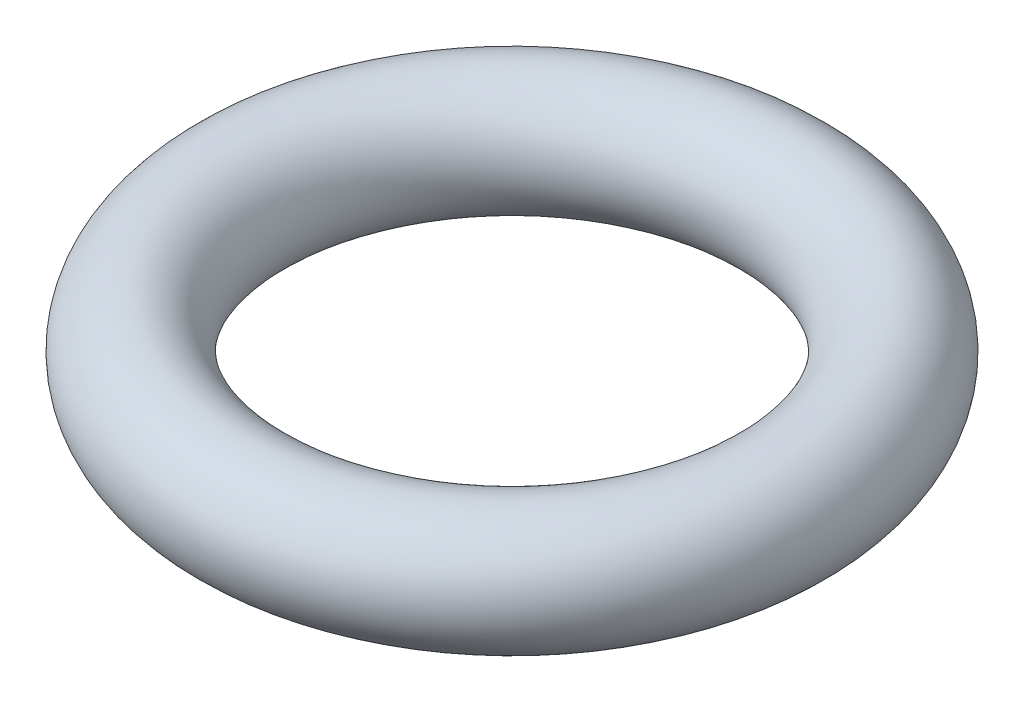
ISO-10303-21;
HEADER;
FILE_DESCRIPTION(('STEP AP214'),'2;1');
FILE_NAME('part.step','',(''),(''),'','','');
FILE_SCHEMA(('AUTOMOTIVE_DESIGN { 1 0 10303 214 1 1 1 1 }'));
ENDSEC;
DATA;
#1=APPLICATION_CONTEXT('core data for automotive mechanical design processes');
#2=APPLICATION_PROTOCOL_DEFINITION('international standard','automotive_design',2000,#1);
#3=PRODUCT_CONTEXT('',#1,'mechanical');
#4=PRODUCT('Part','Part','',(#3));
#5=PRODUCT_RELATED_PRODUCT_CATEGORY('part','',(#4));
#6=PRODUCT_DEFINITION_FORMATION('','',#4);
#7=PRODUCT_DEFINITION_CONTEXT('part definition',#1,'design');
#8=PRODUCT_DEFINITION('design','',#6,#7);
#9=PRODUCT_DEFINITION_SHAPE('','',#8);
#10=(LENGTH_UNIT() NAMED_UNIT(*) SI_UNIT(.MILLI.,.METRE.));
#11=(NAMED_UNIT(*) PLANE_ANGLE_UNIT() SI_UNIT($,.RADIAN.));
#12=(NAMED_UNIT(*) SI_UNIT($,.STERADIAN.) SOLID_ANGLE_UNIT());
#13=UNCERTAINTY_MEASURE_WITH_UNIT(LENGTH_MEASURE(1.E-05),#10,'distance_accuracy_value','');
#14=(GEOMETRIC_REPRESENTATION_CONTEXT(3) GLOBAL_UNCERTAINTY_ASSIGNED_CONTEXT((#13)) GLOBAL_UNIT_ASSIGNED_CONTEXT((#10,
#11,#12)) REPRESENTATION_CONTEXT('',''));
#15=CARTESIAN_POINT('',(0.,0.,0.));
#16=DIRECTION('',(0.,0.,1.));
#17=DIRECTION('',(1.,0.,0.));
#18=AXIS2_PLACEMENT_3D('',#15,#16,#17);
#19=CARTESIAN_POINT('',(0.,0.,0.));
#20=DIRECTION('',(0.,-1.,0.));
#21=DIRECTION('',(0.,0.,-1.));
#22=AXIS2_PLACEMENT_3D('',#19,#20,#21);
#23=TOROIDAL_SURFACE('',#22,4.5,1.);
#24=CARTESIAN_POINT('',(0.,0.,-5.5));
#25=VERTEX_POINT('',#24);
#26=VERTEX_LOOP('',#25);
#27=FACE_BOUND('',#26,.T.);
#28=ADVANCED_FACE('F34',(#27),#23,.T.);
#29=CLOSED_SHELL('',(#28));
#30=MANIFOLD_SOLID_BREP('B2',#29);
#31=ADVANCED_BREP_SHAPE_REPRESENTATION('',(#18,#30),#14);
#32=SHAPE_DEFINITION_REPRESENTATION(#9,#31);
ENDSEC;
END-ISO-10303-21;
